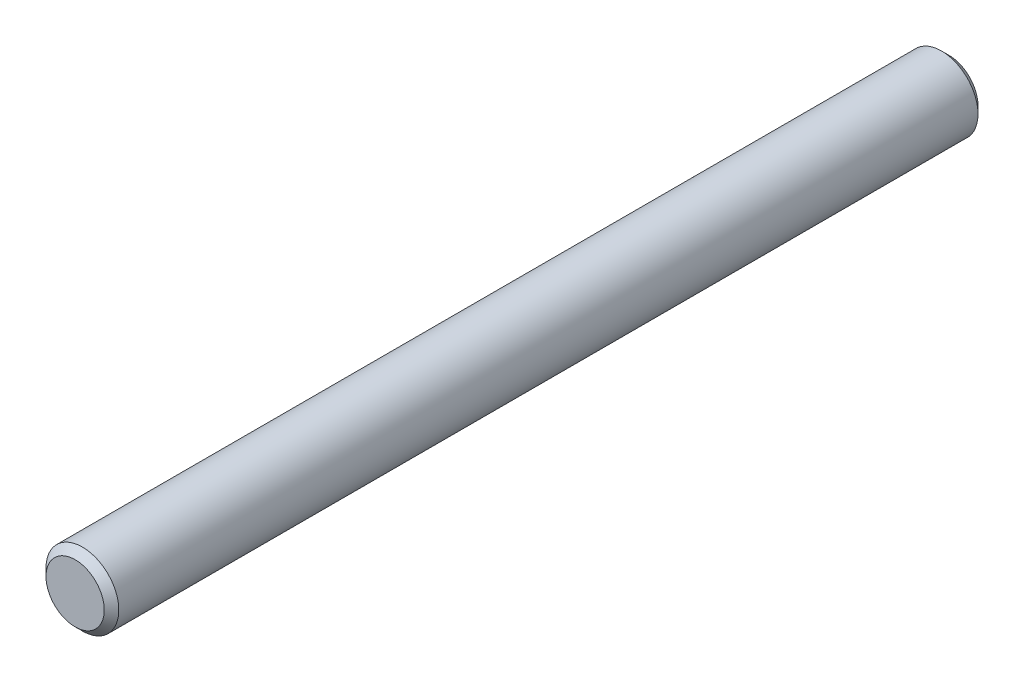
ISO-10303-21;
HEADER;
FILE_DESCRIPTION(('STEP AP214'),'2;1');
FILE_NAME('part.step','',(''),(''),'','','');
FILE_SCHEMA(('AUTOMOTIVE_DESIGN { 1 0 10303 214 1 1 1 1 }'));
ENDSEC;
DATA;
#1=APPLICATION_CONTEXT('core data for automotive mechanical design processes');
#2=APPLICATION_PROTOCOL_DEFINITION('international standard','automotive_design',2000,#1);
#3=PRODUCT_CONTEXT('',#1,'mechanical');
#4=PRODUCT('Part','Part','',(#3));
#5=PRODUCT_RELATED_PRODUCT_CATEGORY('part','',(#4));
#6=PRODUCT_DEFINITION_FORMATION('','',#4);
#7=PRODUCT_DEFINITION_CONTEXT('part definition',#1,'design');
#8=PRODUCT_DEFINITION('design','',#6,#7);
#9=PRODUCT_DEFINITION_SHAPE('','',#8);
#10=(LENGTH_UNIT() NAMED_UNIT(*) SI_UNIT(.MILLI.,.METRE.));
#11=(NAMED_UNIT(*) PLANE_ANGLE_UNIT() SI_UNIT($,.RADIAN.));
#12=(NAMED_UNIT(*) SI_UNIT($,.STERADIAN.) SOLID_ANGLE_UNIT());
#13=UNCERTAINTY_MEASURE_WITH_UNIT(LENGTH_MEASURE(1.E-05),#10,'distance_accuracy_value','');
#14=(GEOMETRIC_REPRESENTATION_CONTEXT(3) GLOBAL_UNCERTAINTY_ASSIGNED_CONTEXT((#13)) GLOBAL_UNIT_ASSIGNED_CONTEXT((#10,
#11,#12)) REPRESENTATION_CONTEXT('',''));
#15=CARTESIAN_POINT('',(0.,0.,0.));
#16=DIRECTION('',(0.,0.,1.));
#17=DIRECTION('',(1.,0.,0.));
#18=AXIS2_PLACEMENT_3D('',#15,#16,#17);
#19=CARTESIAN_POINT('',(0.,0.,60.));
#20=DIRECTION('',(0.,0.,1.));
#21=DIRECTION('',(1.,0.,0.));
#22=AXIS2_PLACEMENT_3D('',#19,#20,#21);
#23=PLANE('',#22);
#24=CARTESIAN_POINT('',(0.,0.,59.9999999999454));
#25=DIRECTION('',(0.,0.,-1.));
#26=DIRECTION('',(-1.,0.,0.));
#27=AXIS2_PLACEMENT_3D('',#24,#25,#26);
#28=CIRCLE('',#27,2.00000000006639);
#29=CARTESIAN_POINT('',(-2.00000000006639,0.,59.9999999999454));
#30=VERTEX_POINT('',#29);
#31=EDGE_CURVE('E18',#30,#30,#28,.T.);
#32=ORIENTED_EDGE('',*,*,#31,.F.);
#33=EDGE_LOOP('',(#32));
#34=FACE_BOUND('',#33,.T.);
#35=ADVANCED_FACE('F15',(#34),#23,.T.);
#36=CARTESIAN_POINT('',(0.,0.,0.));
#37=DIRECTION('',(0.,0.,1.));
#38=DIRECTION('',(1.,0.,0.));
#39=AXIS2_PLACEMENT_3D('',#36,#37,#38);
#40=PLANE('',#39);
#41=CARTESIAN_POINT('',(0.,0.,0.));
#42=DIRECTION('',(0.,0.,1.));
#43=DIRECTION('',(1.,0.,0.));
#44=AXIS2_PLACEMENT_3D('',#41,#42,#43);
#45=CIRCLE('',#44,2.00000000000955);
#46=CARTESIAN_POINT('',(2.00000000000955,0.,0.));
#47=VERTEX_POINT('',#46);
#48=EDGE_CURVE('E27',#47,#47,#45,.T.);
#49=ORIENTED_EDGE('',*,*,#48,.F.);
#50=EDGE_LOOP('',(#49));
#51=FACE_BOUND('',#50,.T.);
#52=ADVANCED_FACE('F38',(#51),#40,.F.);
#53=CARTESIAN_POINT('',(0.,0.,59.5000000000709));
#54=DIRECTION('',(0.,0.,-1.));
#55=DIRECTION('',(-1.,0.,0.));
#56=AXIS2_PLACEMENT_3D('',#53,#54,#55);
#57=CONICAL_SURFACE('',#56,2.49999999994088,0.785398163397448);
#58=CARTESIAN_POINT('',(0.,0.,59.5));
#59=DIRECTION('',(0.,0.,-1.));
#60=DIRECTION('',(-1.,0.,0.));
#61=AXIS2_PLACEMENT_3D('',#58,#59,#60);
#62=CIRCLE('',#61,2.5);
#63=CARTESIAN_POINT('',(-2.5,0.,59.5));
#64=VERTEX_POINT('',#63);
#65=EDGE_CURVE('E22',#64,#64,#62,.T.);
#66=ORIENTED_EDGE('',*,*,#65,.F.);
#67=EDGE_LOOP('',(#66));
#68=FACE_BOUND('',#67,.T.);
#69=ORIENTED_EDGE('',*,*,#31,.T.);
#70=EDGE_LOOP('',(#69));
#71=FACE_BOUND('',#70,.T.);
#72=ADVANCED_FACE('F35',(#68,#71),#57,.T.);
#73=CARTESIAN_POINT('',(0.,0.,0.50000000004502));
#74=DIRECTION('',(0.,0.,1.));
#75=DIRECTION('',(1.,0.,0.));
#76=AXIS2_PLACEMENT_3D('',#73,#74,#75);
#77=CONICAL_SURFACE('',#76,2.50000000005457,0.785398163397448);
#78=CARTESIAN_POINT('',(0.,0.,0.5));
#79=DIRECTION('',(0.,0.,-1.));
#80=DIRECTION('',(-1.,0.,0.));
#81=AXIS2_PLACEMENT_3D('',#78,#79,#80);
#82=CIRCLE('',#81,2.5);
#83=CARTESIAN_POINT('',(-2.5,0.,0.5));
#84=VERTEX_POINT('',#83);
#85=EDGE_CURVE('E10',#84,#84,#82,.F.);
#86=ORIENTED_EDGE('',*,*,#85,.F.);
#87=EDGE_LOOP('',(#86));
#88=FACE_BOUND('',#87,.T.);
#89=ORIENTED_EDGE('',*,*,#48,.T.);
#90=EDGE_LOOP('',(#89));
#91=FACE_BOUND('',#90,.T.);
#92=ADVANCED_FACE('F46',(#88,#91),#77,.T.);
#93=CARTESIAN_POINT('',(0.,0.,60.));
#94=DIRECTION('',(0.,0.,-1.));
#95=DIRECTION('',(-1.,0.,0.));
#96=AXIS2_PLACEMENT_3D('',#93,#94,#95);
#97=CYLINDRICAL_SURFACE('',#96,2.5);
#98=ORIENTED_EDGE('',*,*,#85,.T.);
#99=EDGE_LOOP('',(#98));
#100=FACE_BOUND('',#99,.T.);
#101=ORIENTED_EDGE('',*,*,#65,.T.);
#102=EDGE_LOOP('',(#101));
#103=FACE_BOUND('',#102,.T.);
#104=ADVANCED_FACE('F44',(#100,#103),#97,.T.);
#105=CLOSED_SHELL('',(#35,#52,#72,#92,#104));
#106=MANIFOLD_SOLID_BREP('B1',#105);
#107=ADVANCED_BREP_SHAPE_REPRESENTATION('',(#18,#106),#14);
#108=SHAPE_DEFINITION_REPRESENTATION(#9,#107);
ENDSEC;
END-ISO-10303-21;
